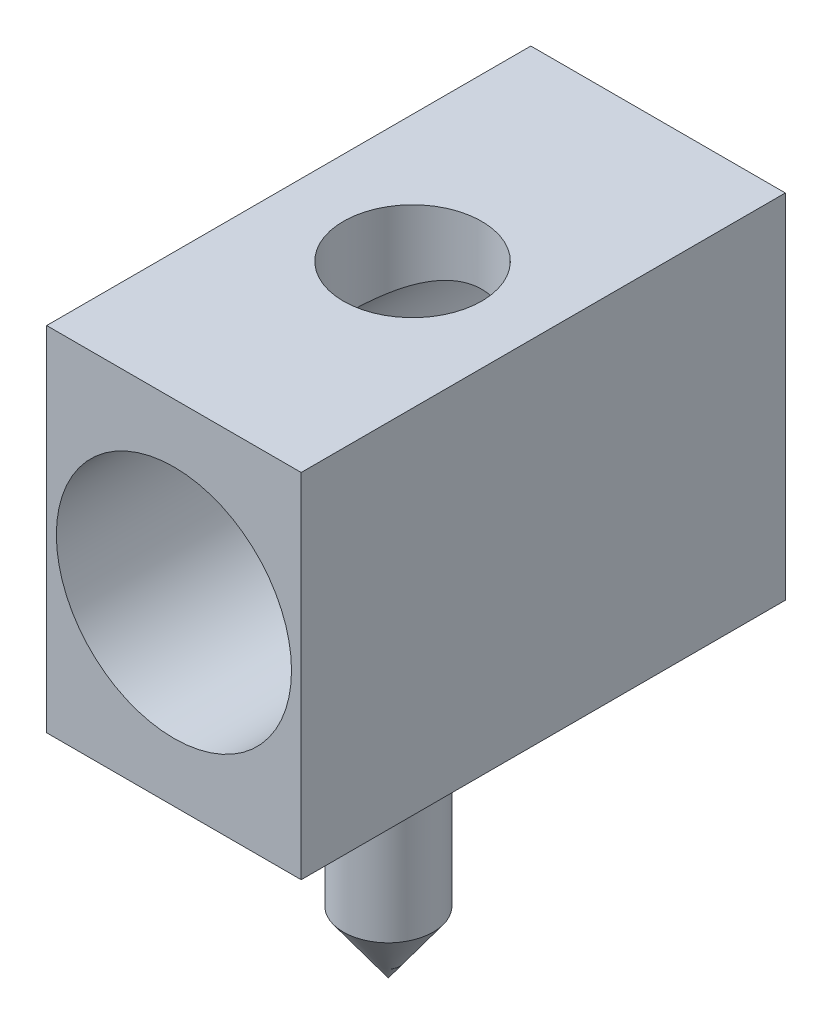
ISO-10303-21;
HEADER;
FILE_DESCRIPTION(('STEP AP214'),'2;1');
FILE_NAME('part.step','',(''),(''),'','','');
FILE_SCHEMA(('AUTOMOTIVE_DESIGN { 1 0 10303 214 1 1 1 1 }'));
ENDSEC;
DATA;
#1=APPLICATION_CONTEXT('core data for automotive mechanical design processes');
#2=APPLICATION_PROTOCOL_DEFINITION('international standard','automotive_design',2000,#1);
#3=PRODUCT_CONTEXT('',#1,'mechanical');
#4=PRODUCT('Part','Part','',(#3));
#5=PRODUCT_RELATED_PRODUCT_CATEGORY('part','',(#4));
#6=PRODUCT_DEFINITION_FORMATION('','',#4);
#7=PRODUCT_DEFINITION_CONTEXT('part definition',#1,'design');
#8=PRODUCT_DEFINITION('design','',#6,#7);
#9=PRODUCT_DEFINITION_SHAPE('','',#8);
#10=(LENGTH_UNIT() NAMED_UNIT(*) SI_UNIT(.MILLI.,.METRE.));
#11=(NAMED_UNIT(*) PLANE_ANGLE_UNIT() SI_UNIT($,.RADIAN.));
#12=(NAMED_UNIT(*) SI_UNIT($,.STERADIAN.) SOLID_ANGLE_UNIT());
#13=UNCERTAINTY_MEASURE_WITH_UNIT(LENGTH_MEASURE(1.E-05),#10,'distance_accuracy_value','');
#14=(GEOMETRIC_REPRESENTATION_CONTEXT(3) GLOBAL_UNCERTAINTY_ASSIGNED_CONTEXT((#13)) GLOBAL_UNIT_ASSIGNED_CONTEXT((#10,
#11,#12)) REPRESENTATION_CONTEXT('',''));
#15=CARTESIAN_POINT('',(0.,0.,0.));
#16=DIRECTION('',(0.,0.,1.));
#17=DIRECTION('',(1.,0.,0.));
#18=AXIS2_PLACEMENT_3D('',#15,#16,#17);
#19=CARTESIAN_POINT('',(0.,5.1,0.));
#20=DIRECTION('',(-1.,0.,0.));
#21=DIRECTION('',(0.,0.,1.));
#22=AXIS2_PLACEMENT_3D('',#19,#20,#21);
#23=PLANE('',#22);
#24=DIRECTION('',(0.,0.,-1.));
#25=VECTOR('',#24,1.);
#26=CARTESIAN_POINT('',(0.,0.,0.));
#27=LINE('',#26,#25);
#28=CARTESIAN_POINT('',(0.,0.,7.));
#29=VERTEX_POINT('',#28);
#30=CARTESIAN_POINT('',(0.,0.,0.));
#31=VERTEX_POINT('',#30);
#32=EDGE_CURVE('E120',#29,#31,#27,.T.);
#33=ORIENTED_EDGE('',*,*,#32,.T.);
#34=DIRECTION('',(0.,-1.,0.));
#35=VECTOR('',#34,1.);
#36=CARTESIAN_POINT('',(0.,5.1,0.));
#37=LINE('',#36,#35);
#38=CARTESIAN_POINT('',(0.,5.1,0.));
#39=VERTEX_POINT('',#38);
#40=EDGE_CURVE('E12',#39,#31,#37,.T.);
#41=ORIENTED_EDGE('',*,*,#40,.F.);
#42=DIRECTION('',(0.,0.,-1.));
#43=VECTOR('',#42,1.);
#44=CARTESIAN_POINT('',(0.,5.1,0.));
#45=LINE('',#44,#43);
#46=CARTESIAN_POINT('',(0.,5.1,7.));
#47=VERTEX_POINT('',#46);
#48=EDGE_CURVE('E121',#47,#39,#45,.T.);
#49=ORIENTED_EDGE('',*,*,#48,.F.);
#50=DIRECTION('',(0.,-1.,0.));
#51=VECTOR('',#50,1.);
#52=CARTESIAN_POINT('',(0.,5.1,7.));
#53=LINE('',#52,#51);
#54=EDGE_CURVE('E131',#47,#29,#53,.T.);
#55=ORIENTED_EDGE('',*,*,#54,.T.);
#56=EDGE_LOOP('',(#33,#41,#49,#55));
#57=FACE_BOUND('',#56,.T.);
#58=ADVANCED_FACE('F41',(#57),#23,.F.);
#59=CARTESIAN_POINT('',(0.,5.1,0.));
#60=DIRECTION('',(0.,0.,1.));
#61=DIRECTION('',(1.,0.,0.));
#62=AXIS2_PLACEMENT_3D('',#59,#60,#61);
#63=PLANE('',#62);
#64=DIRECTION('',(-1.,0.,0.));
#65=VECTOR('',#64,1.);
#66=CARTESIAN_POINT('',(0.,0.,0.));
#67=LINE('',#66,#65);
#68=CARTESIAN_POINT('',(-3.68,0.,0.));
#69=VERTEX_POINT('',#68);
#70=EDGE_CURVE('E135',#31,#69,#67,.T.);
#71=ORIENTED_EDGE('',*,*,#70,.T.);
#72=DIRECTION('',(0.,-1.,0.));
#73=VECTOR('',#72,1.);
#74=CARTESIAN_POINT('',(-3.68,5.1,0.));
#75=LINE('',#74,#73);
#76=CARTESIAN_POINT('',(-3.68,5.1,0.));
#77=VERTEX_POINT('',#76);
#78=EDGE_CURVE('E50',#77,#69,#75,.T.);
#79=ORIENTED_EDGE('',*,*,#78,.F.);
#80=DIRECTION('',(-1.,0.,0.));
#81=VECTOR('',#80,1.);
#82=CARTESIAN_POINT('',(0.,5.1,0.));
#83=LINE('',#82,#81);
#84=EDGE_CURVE('E89',#39,#77,#83,.T.);
#85=ORIENTED_EDGE('',*,*,#84,.F.);
#86=ORIENTED_EDGE('',*,*,#40,.T.);
#87=EDGE_LOOP('',(#71,#79,#85,#86));
#88=FACE_BOUND('',#87,.T.);
#89=ADVANCED_FACE('F166',(#88),#63,.F.);
#90=CARTESIAN_POINT('',(-3.68,5.1,0.));
#91=DIRECTION('',(1.,0.,0.));
#92=DIRECTION('',(0.,0.,-1.));
#93=AXIS2_PLACEMENT_3D('',#90,#91,#92);
#94=PLANE('',#93);
#95=DIRECTION('',(0.,0.,1.));
#96=VECTOR('',#95,1.);
#97=CARTESIAN_POINT('',(-3.68,0.,0.));
#98=LINE('',#97,#96);
#99=CARTESIAN_POINT('',(-3.68,0.,7.));
#100=VERTEX_POINT('',#99);
#101=EDGE_CURVE('E76',#69,#100,#98,.T.);
#102=ORIENTED_EDGE('',*,*,#101,.T.);
#103=DIRECTION('',(0.,-1.,0.));
#104=VECTOR('',#103,1.);
#105=CARTESIAN_POINT('',(-3.68,5.1,7.));
#106=LINE('',#105,#104);
#107=CARTESIAN_POINT('',(-3.68,5.1,7.));
#108=VERTEX_POINT('',#107);
#109=EDGE_CURVE('E144',#108,#100,#106,.T.);
#110=ORIENTED_EDGE('',*,*,#109,.F.);
#111=DIRECTION('',(0.,0.,1.));
#112=VECTOR('',#111,1.);
#113=CARTESIAN_POINT('',(-3.68,5.1,0.));
#114=LINE('',#113,#112);
#115=EDGE_CURVE('E126',#77,#108,#114,.T.);
#116=ORIENTED_EDGE('',*,*,#115,.F.);
#117=ORIENTED_EDGE('',*,*,#78,.T.);
#118=EDGE_LOOP('',(#102,#110,#116,#117));
#119=FACE_BOUND('',#118,.T.);
#120=ADVANCED_FACE('F148',(#119),#94,.F.);
#121=CARTESIAN_POINT('',(0.,5.1,7.));
#122=DIRECTION('',(0.,0.,-1.));
#123=DIRECTION('',(-1.,0.,0.));
#124=AXIS2_PLACEMENT_3D('',#121,#122,#123);
#125=PLANE('',#124);
#126=CARTESIAN_POINT('',(-1.84,2.55,7.));
#127=DIRECTION('',(0.,0.,1.));
#128=DIRECTION('',(1.,0.,0.));
#129=AXIS2_PLACEMENT_3D('',#126,#127,#128);
#130=CIRCLE('',#129,1.7);
#131=CARTESIAN_POINT('',(-0.140000000000001,2.55,7.));
#132=VERTEX_POINT('',#131);
#133=EDGE_CURVE('E103',#132,#132,#130,.T.);
#134=ORIENTED_EDGE('',*,*,#133,.F.);
#135=EDGE_LOOP('',(#134));
#136=FACE_BOUND('',#135,.T.);
#137=DIRECTION('',(1.,0.,0.));
#138=VECTOR('',#137,1.);
#139=CARTESIAN_POINT('',(0.,0.,7.));
#140=LINE('',#139,#138);
#141=EDGE_CURVE('E82',#100,#29,#140,.T.);
#142=ORIENTED_EDGE('',*,*,#141,.T.);
#143=ORIENTED_EDGE('',*,*,#54,.F.);
#144=DIRECTION('',(1.,0.,0.));
#145=VECTOR('',#144,1.);
#146=CARTESIAN_POINT('',(0.,5.1,7.));
#147=LINE('',#146,#145);
#148=EDGE_CURVE('E58',#108,#47,#147,.T.);
#149=ORIENTED_EDGE('',*,*,#148,.F.);
#150=ORIENTED_EDGE('',*,*,#109,.T.);
#151=EDGE_LOOP('',(#142,#143,#149,#150));
#152=FACE_BOUND('',#151,.T.);
#153=ADVANCED_FACE('F155',(#136,#152),#125,.F.);
#154=CARTESIAN_POINT('',(0.,5.1,0.));
#155=DIRECTION('',(0.,-1.,0.));
#156=DIRECTION('',(0.,0.,-1.));
#157=AXIS2_PLACEMENT_3D('',#154,#155,#156);
#158=PLANE('',#157);
#159=CARTESIAN_POINT('',(-1.84,5.1,3.55));
#160=DIRECTION('',(0.,1.,0.));
#161=DIRECTION('',(0.,0.,1.));
#162=AXIS2_PLACEMENT_3D('',#159,#160,#161);
#163=CIRCLE('',#162,1.);
#164=CARTESIAN_POINT('',(-1.84,5.1,4.55));
#165=VERTEX_POINT('',#164);
#166=EDGE_CURVE('E112',#165,#165,#163,.T.);
#167=ORIENTED_EDGE('',*,*,#166,.F.);
#168=EDGE_LOOP('',(#167));
#169=FACE_BOUND('',#168,.T.);
#170=ORIENTED_EDGE('',*,*,#48,.T.);
#171=ORIENTED_EDGE('',*,*,#84,.T.);
#172=ORIENTED_EDGE('',*,*,#115,.T.);
#173=ORIENTED_EDGE('',*,*,#148,.T.);
#174=EDGE_LOOP('',(#170,#171,#172,#173));
#175=FACE_BOUND('',#174,.T.);
#176=ADVANCED_FACE('F157',(#169,#175),#158,.F.);
#177=CARTESIAN_POINT('',(0.,0.,0.));
#178=DIRECTION('',(0.,-1.,0.));
#179=DIRECTION('',(0.,0.,-1.));
#180=AXIS2_PLACEMENT_3D('',#177,#178,#179);
#181=PLANE('',#180);
#182=CARTESIAN_POINT('',(-1.84,0.,3.9));
#183=DIRECTION('',(0.,-1.,0.));
#184=DIRECTION('',(0.,0.,-1.));
#185=AXIS2_PLACEMENT_3D('',#182,#183,#184);
#186=CIRCLE('',#185,0.65);
#187=CARTESIAN_POINT('',(-1.84,0.,3.25));
#188=VERTEX_POINT('',#187);
#189=EDGE_CURVE('E104',#188,#188,#186,.T.);
#190=ORIENTED_EDGE('',*,*,#189,.F.);
#191=EDGE_LOOP('',(#190));
#192=FACE_BOUND('',#191,.T.);
#193=ORIENTED_EDGE('',*,*,#32,.F.);
#194=ORIENTED_EDGE('',*,*,#141,.F.);
#195=ORIENTED_EDGE('',*,*,#101,.F.);
#196=ORIENTED_EDGE('',*,*,#70,.F.);
#197=EDGE_LOOP('',(#193,#194,#195,#196));
#198=FACE_BOUND('',#197,.T.);
#199=ADVANCED_FACE('F151',(#192,#198),#181,.T.);
#200=CARTESIAN_POINT('',(-1.84,2.55,-4.80832611206852));
#201=DIRECTION('',(0.,0.,1.));
#202=DIRECTION('',(1.,0.,0.));
#203=AXIS2_PLACEMENT_3D('',#200,#201,#202);
#204=CYLINDRICAL_SURFACE('',#203,1.7);
#205=CARTESIAN_POINT('',(-1.84,4.25,4.55));
#206=CARTESIAN_POINT('',(-1.89131803497845,4.24999410023928,4.54999327322667));
#207=CARTESIAN_POINT('',(-1.94271935680999,4.24764993799426,4.54602119696414));
#208=CARTESIAN_POINT('',(-2.04399318657702,4.2384876106981,4.53032074836006));
#209=CARTESIAN_POINT('',(-2.09386117759117,4.23165734735164,4.51857140129453));
#210=CARTESIAN_POINT('',(-2.19037325046206,4.21422083608691,4.48797018614886));
#211=CARTESIAN_POINT('',(-2.2370319459395,4.20363327387324,4.4691534389329));
#212=CARTESIAN_POINT('',(-2.32638951086915,4.17959174545448,4.42516161918129));
#213=CARTESIAN_POINT('',(-2.36908961907518,4.16613868032134,4.39998854496451));
#214=CARTESIAN_POINT('',(-2.45293489615153,4.13632759073906,4.34189866757455));
#215=CARTESIAN_POINT('',(-2.49372494638733,4.11982755696817,4.3085435277408));
#216=CARTESIAN_POINT('',(-2.56947882752151,4.08609377671936,4.23601430386098));
#217=CARTESIAN_POINT('',(-2.6044352501145,4.06885913166579,4.19683293847129));
#218=CARTESIAN_POINT('',(-2.67166318673247,4.03322129490191,4.10836730694491));
#219=CARTESIAN_POINT('',(-2.70314450708417,4.01491666038645,4.05843756880021));
#220=CARTESIAN_POINT('',(-2.75714284178125,3.98173260025701,3.95292240084864));
#221=CARTESIAN_POINT('',(-2.77967405631316,3.96684776476045,3.8973461072205));
#222=CARTESIAN_POINT('',(-2.81053708445836,3.94582300160015,3.79535173715348));
#223=CARTESIAN_POINT('',(-2.82095462804398,3.93845336519117,3.74981909148865));
#224=CARTESIAN_POINT('',(-2.83532863683507,3.92818800101327,3.65727123675351));
#225=CARTESIAN_POINT('',(-2.83929265853764,3.9252870410384,3.61025782740096));
#226=CARTESIAN_POINT('',(-2.84053477168783,3.92438389389642,3.51601490532886));
#227=CARTESIAN_POINT('',(-2.83780151093905,3.92639002445954,3.4687851613158));
#228=CARTESIAN_POINT('',(-2.82579470522658,3.93501288841364,3.37558609294943));
#229=CARTESIAN_POINT('',(-2.81651641005066,3.94163297044628,3.32961770924711));
#230=CARTESIAN_POINT('',(-2.79200942340753,3.95850777355865,3.2404877420208));
#231=CARTESIAN_POINT('',(-2.77683449706818,3.96872957799938,3.19730479583399));
#232=CARTESIAN_POINT('',(-2.74107754218844,3.99170383980616,3.11397514108398));
#233=CARTESIAN_POINT('',(-2.72049349488518,4.00445724156566,3.07382957333437));
#234=CARTESIAN_POINT('',(-2.67049107957876,4.0336631611537,2.99051165603131));
#235=CARTESIAN_POINT('',(-2.64016778930771,4.05037663717306,2.94797338535554));
#236=CARTESIAN_POINT('',(-2.57335439018367,4.08414304999764,2.86816146202503));
#237=CARTESIAN_POINT('',(-2.53685863593155,4.10119628483883,2.83089268671765));
#238=CARTESIAN_POINT('',(-2.45314699611974,4.13630502950394,2.75783977392327));
#239=CARTESIAN_POINT('',(-2.4051563380307,4.15420808949145,2.72286067414665));
#240=CARTESIAN_POINT('',(-2.30288343782058,4.18664584537057,2.66158279023182));
#241=CARTESIAN_POINT('',(-2.24860488110715,4.2011824995149,2.6352789558578));
#242=CARTESIAN_POINT('',(-2.13892953518549,4.22438661165873,2.59404968799971));
#243=CARTESIAN_POINT('',(-2.0838433487633,4.23337828753048,2.57848751412608));
#244=CARTESIAN_POINT('',(-1.97123726141556,4.24586934519517,2.556998664063));
#245=CARTESIAN_POINT('',(-1.91372012755087,4.24937480757303,2.55106132003661));
#246=CARTESIAN_POINT('',(-1.80598397253218,4.25040122159357,2.54931924508742));
#247=CARTESIAN_POINT('',(-1.75578661514114,4.24863984127428,2.55229943735099));
#248=CARTESIAN_POINT('',(-1.65673777190282,4.24082277050258,2.56566706229136));
#249=CARTESIAN_POINT('',(-1.60788628193394,4.2347670932026,2.57605447228158));
#250=CARTESIAN_POINT('',(-1.51371139161639,4.21906466553636,2.60348007764104));
#251=CARTESIAN_POINT('',(-1.4683400152748,4.20948516178643,2.62039400337803));
#252=CARTESIAN_POINT('',(-1.38107171262284,4.18750181475344,2.66023161976418));
#253=CARTESIAN_POINT('',(-1.33917553295261,4.17509736666901,2.68315659749799));
#254=CARTESIAN_POINT('',(-1.25533217293143,4.14697116240918,2.73704251631384));
#255=CARTESIAN_POINT('',(-1.21383495126022,4.13103839379551,2.76859203593648));
#256=CARTESIAN_POINT('',(-1.13640411479647,4.09813655638042,2.83750841353063));
#257=CARTESIAN_POINT('',(-1.10047708447221,4.08116629369888,2.87488205310863));
#258=CARTESIAN_POINT('',(-1.03068565479908,4.04556843659559,2.95975483691244));
#259=CARTESIAN_POINT('',(-0.99761572646244,4.02699309373539,3.00793375284164));
#260=CARTESIAN_POINT('',(-0.940061170223622,3.99264904191332,3.1100732607766));
#261=CARTESIAN_POINT('',(-0.915566362574469,3.97687701609159,3.16402689738169));
#262=CARTESIAN_POINT('',(-0.880508503403826,3.95346765140346,3.26441377164737));
#263=CARTESIAN_POINT('',(-0.868079221206015,3.94480915825571,3.30995509137917));
#264=CARTESIAN_POINT('',(-0.84974596416028,3.93185610566699,3.40291442469486));
#265=CARTESIAN_POINT('',(-0.843833591364987,3.92755593050189,3.45032994125601));
#266=CARTESIAN_POINT('',(-0.838862388035959,3.92394850500059,3.54585934230938));
#267=CARTESIAN_POINT('',(-0.839823989587827,3.92465613973168,3.59397488421324));
#268=CARTESIAN_POINT('',(-0.848587359094466,3.93098800296109,3.68925897413977));
#269=CARTESIAN_POINT('',(-0.856393196760795,3.93661515669213,3.73642694164451));
#270=CARTESIAN_POINT('',(-0.87801698436959,3.951696294705,3.8269117161348));
#271=CARTESIAN_POINT('',(-0.891617097411662,3.96101082969281,3.87030534780372));
#272=CARTESIAN_POINT('',(-0.92424682537146,3.98240202944237,3.95426120362031));
#273=CARTESIAN_POINT('',(-0.943278482525735,3.99447973280371,3.99482235561466));
#274=CARTESIAN_POINT('',(-0.989623922510103,4.02231037412725,4.07867521921186));
#275=CARTESIAN_POINT('',(-1.01776387596469,4.03834281574104,4.12141701948725));
#276=CARTESIAN_POINT('',(-1.08006273415387,4.07109689419903,4.20199107626764));
#277=CARTESIAN_POINT('',(-1.11422645021337,4.08781907371287,4.23981936597211));
#278=CARTESIAN_POINT('',(-1.19353145596161,4.12296639187808,4.3151745248257));
#279=CARTESIAN_POINT('',(-1.23954810989804,4.14128084274615,4.35184081558368));
#280=CARTESIAN_POINT('',(-1.33808691498453,4.17505114652399,4.4169286289349));
#281=CARTESIAN_POINT('',(-1.3906107923007,4.19050623821119,4.44534795715183));
#282=CARTESIAN_POINT('',(-1.49852050620065,4.21623422240712,4.49164230701031));
#283=CARTESIAN_POINT('',(-1.55368709580966,4.22670088466611,4.50991715990999));
#284=CARTESIAN_POINT('',(-1.66697077165339,4.24212754985982,4.53661950420438));
#285=CARTESIAN_POINT('',(-1.72507560025129,4.24710872767446,4.54508486851543));
#286=CARTESIAN_POINT('',(-1.80227932852193,4.24968832027385,4.54946902656456));
#287=CARTESIAN_POINT('',(-1.82113403612711,4.25000216891922,4.55000247295249));
#288=CARTESIAN_POINT('',(-1.84,4.25,4.55));
#289=B_SPLINE_CURVE_WITH_KNOTS('',3,(#205,#206,#207,#208,#209,#210,#211,#212,#213,#214,#215,
#216,#217,#218,#219,#220,#221,#222,#223,#224,#225,#226,#227,#228,#229,#230,#231,#232,#233,#234,
#235,#236,#237,#238,#239,#240,#241,#242,#243,#244,#245,#246,#247,#248,#249,#250,#251,#252,#253,
#254,#255,#256,#257,#258,#259,#260,#261,#262,#263,#264,#265,#266,#267,#268,#269,#270,#271,#272,
#273,#274,#275,#276,#277,#278,#279,#280,#281,#282,#283,#284,#285,#286,#287,#288),.UNSPECIFIED.,
.T.,.F.,(4,2,2,2,2,2,2,2,2,2,2,2,2,2,2,2,2,2,2,2,2,2,2,2,2,2,2,2,2,2,2,2,2,2,2,2,2,2,2,2,2,4),
(0.,0.153898607463195,0.308213968425529,0.461772405684242,0.615282626811644,0.780273486605487,
0.945472304750705,1.12996196656506,1.31415773768824,1.45541264358855,1.59650203335539,
1.73783074140147,1.87926212774553,2.01943311736974,2.15965649533469,2.32356441755291,
2.4876230704636,2.67274650290838,2.85776197623356,3.03055834364575,3.20316305811549,
3.3533657651904,3.50356801223099,3.65104118125588,3.79854595301438,3.96142716644183,
4.12449947579138,4.30758816614897,4.4904587642305,4.63384016610593,4.77703658423451,
4.92065881358884,5.06436650138227,5.20309153046565,5.34186878842017,5.50213770893435,
5.6625352248352,5.84649485441748,6.03050338773644,6.20662286413556,6.38206008081869,
6.43863756999392),.UNSPECIFIED.);
#290=CARTESIAN_POINT('',(-1.84,4.25,4.55));
#291=VERTEX_POINT('',#290);
#292=EDGE_CURVE('E251',#291,#291,#289,.T.);
#293=ORIENTED_EDGE('',*,*,#292,.F.);
#294=EDGE_LOOP('',(#293));
#295=FACE_BOUND('',#294,.T.);
#296=CARTESIAN_POINT('',(-1.84,2.55,0.5));
#297=DIRECTION('',(0.,0.,1.));
#298=DIRECTION('',(1.,0.,0.));
#299=AXIS2_PLACEMENT_3D('',#296,#297,#298);
#300=CIRCLE('',#299,1.7);
#301=CARTESIAN_POINT('',(-0.140000000000001,2.55,0.499999999999999));
#302=VERTEX_POINT('',#301);
#303=EDGE_CURVE('E109',#302,#302,#300,.F.);
#304=ORIENTED_EDGE('',*,*,#303,.T.);
#305=EDGE_LOOP('',(#304));
#306=FACE_BOUND('',#305,.T.);
#307=ORIENTED_EDGE('',*,*,#133,.T.);
#308=EDGE_LOOP('',(#307));
#309=FACE_BOUND('',#308,.T.);
#310=ADVANCED_FACE('F196',(#295,#306,#309),#204,.F.);
#311=CARTESIAN_POINT('',(0.,5.1,0.5));
#312=DIRECTION('',(0.,0.,1.));
#313=DIRECTION('',(1.,0.,0.));
#314=AXIS2_PLACEMENT_3D('',#311,#312,#313);
#315=PLANE('',#314);
#316=ORIENTED_EDGE('',*,*,#303,.F.);
#317=EDGE_LOOP('',(#316));
#318=FACE_BOUND('',#317,.T.);
#319=ADVANCED_FACE('F190',(#318),#315,.T.);
#320=CARTESIAN_POINT('',(-1.84,-2.8,3.9));
#321=DIRECTION('',(0.,1.,0.));
#322=DIRECTION('',(0.,0.,1.));
#323=AXIS2_PLACEMENT_3D('',#320,#321,#322);
#324=CYLINDRICAL_SURFACE('',#323,0.65);
#325=CARTESIAN_POINT('',(-1.84,-2.8,3.9));
#326=DIRECTION('',(0.,-1.,0.));
#327=DIRECTION('',(0.,0.,-1.));
#328=AXIS2_PLACEMENT_3D('',#325,#326,#327);
#329=CIRCLE('',#328,0.65);
#330=CARTESIAN_POINT('',(-1.84,-2.8,3.25));
#331=VERTEX_POINT('',#330);
#332=EDGE_CURVE('E100',#331,#331,#329,.T.);
#333=ORIENTED_EDGE('',*,*,#332,.F.);
#334=EDGE_LOOP('',(#333));
#335=FACE_BOUND('',#334,.T.);
#336=ORIENTED_EDGE('',*,*,#189,.T.);
#337=EDGE_LOOP('',(#336));
#338=FACE_BOUND('',#337,.T.);
#339=ADVANCED_FACE('F195',(#335,#338),#324,.T.);
#340=CARTESIAN_POINT('',(-1.84,-2.801,3.55));
#341=DIRECTION('',(0.,1.,0.));
#342=DIRECTION('',(0.,0.,1.));
#343=AXIS2_PLACEMENT_3D('',#340,#341,#342);
#344=CYLINDRICAL_SURFACE('',#343,1.);
#345=ORIENTED_EDGE('',*,*,#166,.T.);
#346=EDGE_LOOP('',(#345));
#347=FACE_BOUND('',#346,.T.);
#348=ORIENTED_EDGE('',*,*,#292,.T.);
#349=EDGE_LOOP('',(#348));
#350=FACE_BOUND('',#349,.T.);
#351=ADVANCED_FACE('F96',(#347,#350),#344,.F.);
#352=CARTESIAN_POINT('',(-1.84,-2.8,3.9));
#353=DIRECTION('',(0.,1.,0.));
#354=DIRECTION('',(0.,0.,1.));
#355=AXIS2_PLACEMENT_3D('',#352,#353,#354);
#356=CONICAL_SURFACE('',#355,0.65,0.625485040239229);
#357=CARTESIAN_POINT('',(-1.84,-3.7,3.9));
#358=VERTEX_POINT('',#357);
#359=VERTEX_LOOP('',#358);
#360=FACE_BOUND('',#359,.T.);
#361=ORIENTED_EDGE('',*,*,#332,.T.);
#362=EDGE_LOOP('',(#361));
#363=FACE_BOUND('',#362,.T.);
#364=ADVANCED_FACE('F93',(#360,#363),#356,.T.);
#365=CLOSED_SHELL('',(#58,#89,#120,#153,#176,#199,#310,#319,#339,#351,#364));
#366=MANIFOLD_SOLID_BREP('B2',#365);
#367=ADVANCED_BREP_SHAPE_REPRESENTATION('',(#18,#366),#14);
#368=SHAPE_DEFINITION_REPRESENTATION(#9,#367);
ENDSEC;
END-ISO-10303-21;
